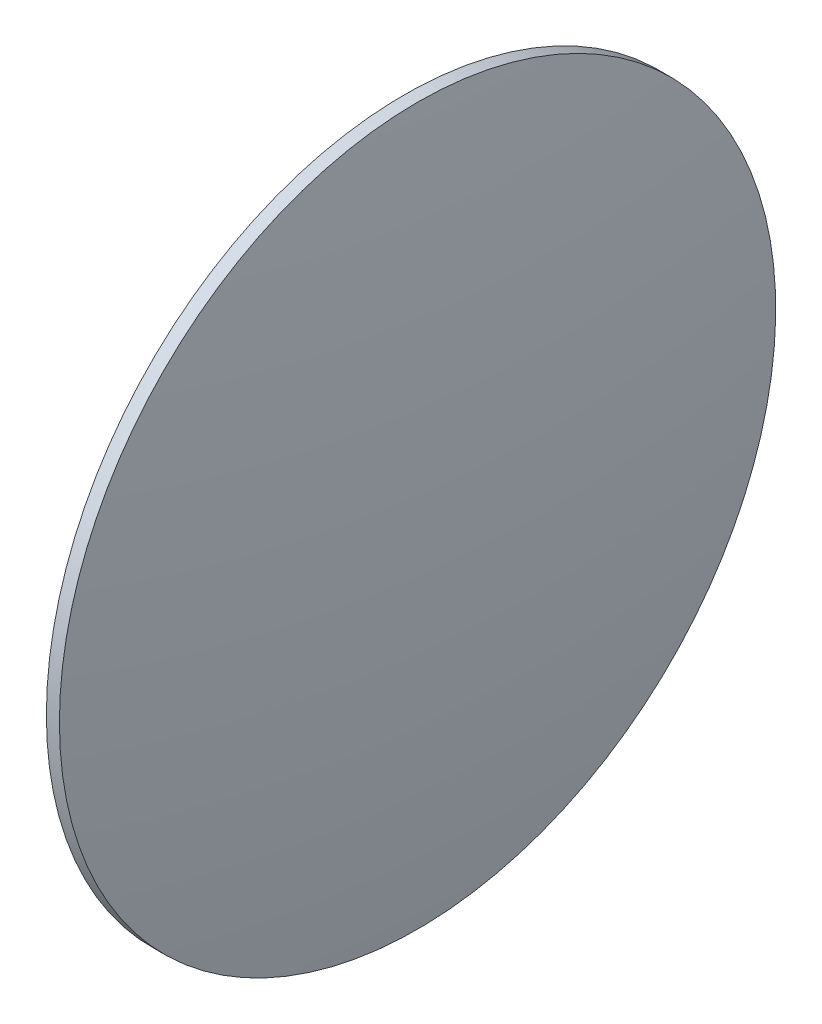
ISO-10303-21;
HEADER;
FILE_DESCRIPTION(('STEP AP214'),'2;1');
FILE_NAME('part.step','',(''),(''),'','','');
FILE_SCHEMA(('AUTOMOTIVE_DESIGN { 1 0 10303 214 1 1 1 1 }'));
ENDSEC;
DATA;
#1=APPLICATION_CONTEXT('core data for automotive mechanical design processes');
#2=APPLICATION_PROTOCOL_DEFINITION('international standard','automotive_design',2000,#1);
#3=PRODUCT_CONTEXT('',#1,'mechanical');
#4=PRODUCT('Part','Part','',(#3));
#5=PRODUCT_RELATED_PRODUCT_CATEGORY('part','',(#4));
#6=PRODUCT_DEFINITION_FORMATION('','',#4);
#7=PRODUCT_DEFINITION_CONTEXT('part definition',#1,'design');
#8=PRODUCT_DEFINITION('design','',#6,#7);
#9=PRODUCT_DEFINITION_SHAPE('','',#8);
#10=(LENGTH_UNIT() NAMED_UNIT(*) SI_UNIT(.MILLI.,.METRE.));
#11=(NAMED_UNIT(*) PLANE_ANGLE_UNIT() SI_UNIT($,.RADIAN.));
#12=(NAMED_UNIT(*) SI_UNIT($,.STERADIAN.) SOLID_ANGLE_UNIT());
#13=UNCERTAINTY_MEASURE_WITH_UNIT(LENGTH_MEASURE(1.E-05),#10,'distance_accuracy_value','');
#14=(GEOMETRIC_REPRESENTATION_CONTEXT(3) GLOBAL_UNCERTAINTY_ASSIGNED_CONTEXT((#13)) GLOBAL_UNIT_ASSIGNED_CONTEXT((#10,
#11,#12)) REPRESENTATION_CONTEXT('',''));
#15=CARTESIAN_POINT('',(0.,0.,0.));
#16=DIRECTION('',(0.,0.,1.));
#17=DIRECTION('',(1.,0.,0.));
#18=AXIS2_PLACEMENT_3D('',#15,#16,#17);
#19=CARTESIAN_POINT('',(0.,27.4760495093355,0.));
#20=DIRECTION('',(1.,0.,0.));
#21=DIRECTION('',(0.,0.,-1.));
#22=AXIS2_PLACEMENT_3D('',#19,#20,#21);
#23=PLANE('',#22);
#24=CARTESIAN_POINT('',(0.,0.,0.));
#25=DIRECTION('',(-1.,0.,0.));
#26=DIRECTION('',(0.,0.,1.));
#27=AXIS2_PLACEMENT_3D('',#24,#25,#26);
#28=CIRCLE('',#27,27.4760495093355);
#29=CARTESIAN_POINT('',(0.,0.,27.4760495093355));
#30=VERTEX_POINT('',#29);
#31=EDGE_CURVE('E10',#30,#30,#28,.T.);
#32=ORIENTED_EDGE('',*,*,#31,.T.);
#33=EDGE_LOOP('',(#32));
#34=FACE_BOUND('',#33,.T.);
#35=ADVANCED_FACE('F31',(#34),#23,.F.);
#36=CARTESIAN_POINT('',(-100.,0.,0.));
#37=DIRECTION('',(-1.,0.,0.));
#38=DIRECTION('',(0.,0.,1.));
#39=AXIS2_PLACEMENT_3D('',#36,#37,#38);
#40=CYLINDRICAL_SURFACE('',#39,27.4760495093355);
#41=ORIENTED_EDGE('',*,*,#31,.F.);
#42=EDGE_LOOP('',(#41));
#43=FACE_BOUND('',#42,.T.);
#44=CARTESIAN_POINT('',(1.00000000000001,0.,0.));
#45=DIRECTION('',(-1.,0.,0.));
#46=DIRECTION('',(0.,0.,1.));
#47=AXIS2_PLACEMENT_3D('',#44,#45,#46);
#48=CIRCLE('',#47,27.4760495093355);
#49=CARTESIAN_POINT('',(1.00000000000001,0.,27.4760495093355));
#50=VERTEX_POINT('',#49);
#51=EDGE_CURVE('E37',#50,#50,#48,.T.);
#52=ORIENTED_EDGE('',*,*,#51,.T.);
#53=EDGE_LOOP('',(#52));
#54=FACE_BOUND('',#53,.T.);
#55=ADVANCED_FACE('F43',(#43,#54),#40,.T.);
#56=CARTESIAN_POINT('',(-197.103676652809,0.,0.));
#57=DIRECTION('',(-1.,0.,0.));
#58=DIRECTION('',(0.,1.,0.));
#59=AXIS2_PLACEMENT_3D('',#56,#57,#58);
#60=SPHERICAL_SURFACE('',#59,200.);
#61=ORIENTED_EDGE('',*,*,#51,.F.);
#62=EDGE_LOOP('',(#61));
#63=FACE_BOUND('',#62,.T.);
#64=ADVANCED_FACE('F45',(#63),#60,.T.);
#65=CLOSED_SHELL('',(#35,#55,#64));
#66=MANIFOLD_SOLID_BREP('B2',#65);
#67=ADVANCED_BREP_SHAPE_REPRESENTATION('',(#18,#66),#14);
#68=SHAPE_DEFINITION_REPRESENTATION(#9,#67);
ENDSEC;
END-ISO-10303-21;
